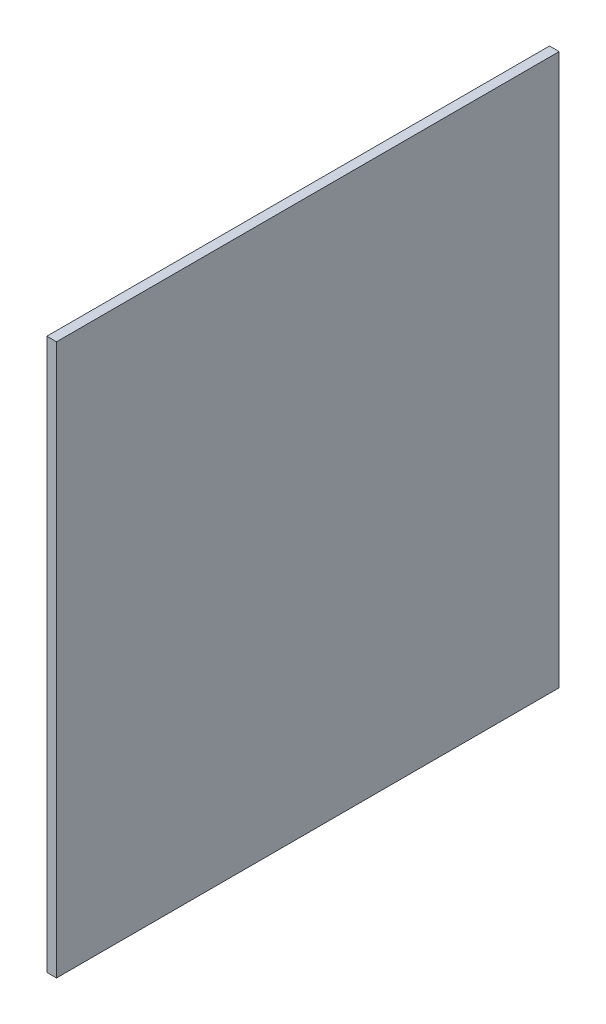
ISO-10303-21;
HEADER;
FILE_DESCRIPTION(('STEP AP214'),'2;1');
FILE_NAME('part.step','',(''),(''),'','','');
FILE_SCHEMA(('AUTOMOTIVE_DESIGN { 1 0 10303 214 1 1 1 1 }'));
ENDSEC;
DATA;
#1=APPLICATION_CONTEXT('core data for automotive mechanical design processes');
#2=APPLICATION_PROTOCOL_DEFINITION('international standard','automotive_design',2000,#1);
#3=PRODUCT_CONTEXT('',#1,'mechanical');
#4=PRODUCT('Part','Part','',(#3));
#5=PRODUCT_RELATED_PRODUCT_CATEGORY('part','',(#4));
#6=PRODUCT_DEFINITION_FORMATION('','',#4);
#7=PRODUCT_DEFINITION_CONTEXT('part definition',#1,'design');
#8=PRODUCT_DEFINITION('design','',#6,#7);
#9=PRODUCT_DEFINITION_SHAPE('','',#8);
#10=(LENGTH_UNIT() NAMED_UNIT(*) SI_UNIT(.MILLI.,.METRE.));
#11=(NAMED_UNIT(*) PLANE_ANGLE_UNIT() SI_UNIT($,.RADIAN.));
#12=(NAMED_UNIT(*) SI_UNIT($,.STERADIAN.) SOLID_ANGLE_UNIT());
#13=UNCERTAINTY_MEASURE_WITH_UNIT(LENGTH_MEASURE(1.E-05),#10,'distance_accuracy_value','');
#14=(GEOMETRIC_REPRESENTATION_CONTEXT(3) GLOBAL_UNCERTAINTY_ASSIGNED_CONTEXT((#13)) GLOBAL_UNIT_ASSIGNED_CONTEXT((#10,
#11,#12)) REPRESENTATION_CONTEXT('',''));
#15=CARTESIAN_POINT('',(0.,0.,0.));
#16=DIRECTION('',(0.,0.,1.));
#17=DIRECTION('',(1.,0.,0.));
#18=AXIS2_PLACEMENT_3D('',#15,#16,#17);
#19=CARTESIAN_POINT('',(10.,232.128252788104,406.877323420075));
#20=DIRECTION('',(0.,0.,-1.));
#21=DIRECTION('',(0.,1.,0.));
#22=AXIS2_PLACEMENT_3D('',#19,#20,#21);
#23=PLANE('',#22);
#24=DIRECTION('',(0.,-1.,0.));
#25=VECTOR('',#24,1.);
#26=CARTESIAN_POINT('',(0.,232.128252788104,406.877323420075));
#27=LINE('',#26,#25);
#28=CARTESIAN_POINT('',(0.,232.128252788104,406.877323420075));
#29=VERTEX_POINT('',#28);
#30=CARTESIAN_POINT('',(0.,-337.871747211896,406.877323420074));
#31=VERTEX_POINT('',#30);
#32=EDGE_CURVE('E96',#29,#31,#27,.T.);
#33=ORIENTED_EDGE('',*,*,#32,.T.);
#34=DIRECTION('',(-1.,0.,0.));
#35=VECTOR('',#34,1.);
#36=CARTESIAN_POINT('',(10.,-337.871747211896,406.877323420074));
#37=LINE('',#36,#35);
#38=CARTESIAN_POINT('',(10.,-337.871747211896,406.877323420074));
#39=VERTEX_POINT('',#38);
#40=EDGE_CURVE('E11',#39,#31,#37,.T.);
#41=ORIENTED_EDGE('',*,*,#40,.F.);
#42=DIRECTION('',(0.,-1.,0.));
#43=VECTOR('',#42,1.);
#44=CARTESIAN_POINT('',(10.,232.128252788104,406.877323420075));
#45=LINE('',#44,#43);
#46=CARTESIAN_POINT('',(10.,232.128252788104,406.877323420075));
#47=VERTEX_POINT('',#46);
#48=EDGE_CURVE('E84',#47,#39,#45,.T.);
#49=ORIENTED_EDGE('',*,*,#48,.F.);
#50=DIRECTION('',(-1.,0.,0.));
#51=VECTOR('',#50,1.);
#52=CARTESIAN_POINT('',(10.,232.128252788104,406.877323420075));
#53=LINE('',#52,#51);
#54=EDGE_CURVE('E92',#47,#29,#53,.T.);
#55=ORIENTED_EDGE('',*,*,#54,.T.);
#56=EDGE_LOOP('',(#33,#41,#49,#55));
#57=FACE_BOUND('',#56,.T.);
#58=ADVANCED_FACE('F33',(#57),#23,.F.);
#59=CARTESIAN_POINT('',(10.,-337.871747211896,406.877323420074));
#60=DIRECTION('',(0.,1.,0.));
#61=DIRECTION('',(0.,0.,1.));
#62=AXIS2_PLACEMENT_3D('',#59,#60,#61);
#63=PLANE('',#62);
#64=DIRECTION('',(0.,0.,-1.));
#65=VECTOR('',#64,1.);
#66=CARTESIAN_POINT('',(0.,-337.871747211896,406.877323420074));
#67=LINE('',#66,#65);
#68=CARTESIAN_POINT('',(0.,-337.871747211896,-113.122676579926));
#69=VERTEX_POINT('',#68);
#70=EDGE_CURVE('E88',#31,#69,#67,.T.);
#71=ORIENTED_EDGE('',*,*,#70,.T.);
#72=DIRECTION('',(-1.,0.,0.));
#73=VECTOR('',#72,1.);
#74=CARTESIAN_POINT('',(10.,-337.871747211896,-113.122676579926));
#75=LINE('',#74,#73);
#76=CARTESIAN_POINT('',(10.,-337.871747211896,-113.122676579926));
#77=VERTEX_POINT('',#76);
#78=EDGE_CURVE('E41',#77,#69,#75,.T.);
#79=ORIENTED_EDGE('',*,*,#78,.F.);
#80=DIRECTION('',(0.,0.,-1.));
#81=VECTOR('',#80,1.);
#82=CARTESIAN_POINT('',(10.,-337.871747211896,406.877323420074));
#83=LINE('',#82,#81);
#84=EDGE_CURVE('E79',#39,#77,#83,.T.);
#85=ORIENTED_EDGE('',*,*,#84,.F.);
#86=ORIENTED_EDGE('',*,*,#40,.T.);
#87=EDGE_LOOP('',(#71,#79,#85,#86));
#88=FACE_BOUND('',#87,.T.);
#89=ADVANCED_FACE('F87',(#88),#63,.F.);
#90=CARTESIAN_POINT('',(10.,232.128252788104,-113.122676579926));
#91=DIRECTION('',(0.,0.,1.));
#92=DIRECTION('',(0.,-1.,0.));
#93=AXIS2_PLACEMENT_3D('',#90,#91,#92);
#94=PLANE('',#93);
#95=DIRECTION('',(0.,1.,0.));
#96=VECTOR('',#95,1.);
#97=CARTESIAN_POINT('',(0.,232.128252788104,-113.122676579926));
#98=LINE('',#97,#96);
#99=CARTESIAN_POINT('',(0.,232.128252788104,-113.122676579926));
#100=VERTEX_POINT('',#99);
#101=EDGE_CURVE('E66',#69,#100,#98,.T.);
#102=ORIENTED_EDGE('',*,*,#101,.T.);
#103=DIRECTION('',(-1.,0.,0.));
#104=VECTOR('',#103,1.);
#105=CARTESIAN_POINT('',(10.,232.128252788104,-113.122676579926));
#106=LINE('',#105,#104);
#107=CARTESIAN_POINT('',(10.,232.128252788104,-113.122676579926));
#108=VERTEX_POINT('',#107);
#109=EDGE_CURVE('E89',#108,#100,#106,.T.);
#110=ORIENTED_EDGE('',*,*,#109,.F.);
#111=DIRECTION('',(0.,1.,0.));
#112=VECTOR('',#111,1.);
#113=CARTESIAN_POINT('',(10.,232.128252788104,-113.122676579926));
#114=LINE('',#113,#112);
#115=EDGE_CURVE('E82',#77,#108,#114,.T.);
#116=ORIENTED_EDGE('',*,*,#115,.F.);
#117=ORIENTED_EDGE('',*,*,#78,.T.);
#118=EDGE_LOOP('',(#102,#110,#116,#117));
#119=FACE_BOUND('',#118,.T.);
#120=ADVANCED_FACE('F90',(#119),#94,.F.);
#121=CARTESIAN_POINT('',(10.,232.128252788104,406.877323420075));
#122=DIRECTION('',(0.,-1.,0.));
#123=DIRECTION('',(0.,0.,-1.));
#124=AXIS2_PLACEMENT_3D('',#121,#122,#123);
#125=PLANE('',#124);
#126=DIRECTION('',(0.,0.,1.));
#127=VECTOR('',#126,1.);
#128=CARTESIAN_POINT('',(0.,232.128252788104,406.877323420075));
#129=LINE('',#128,#127);
#130=EDGE_CURVE('E72',#100,#29,#129,.T.);
#131=ORIENTED_EDGE('',*,*,#130,.T.);
#132=ORIENTED_EDGE('',*,*,#54,.F.);
#133=DIRECTION('',(0.,0.,1.));
#134=VECTOR('',#133,1.);
#135=CARTESIAN_POINT('',(10.,232.128252788104,406.877323420075));
#136=LINE('',#135,#134);
#137=EDGE_CURVE('E49',#108,#47,#136,.T.);
#138=ORIENTED_EDGE('',*,*,#137,.F.);
#139=ORIENTED_EDGE('',*,*,#109,.T.);
#140=EDGE_LOOP('',(#131,#132,#138,#139));
#141=FACE_BOUND('',#140,.T.);
#142=ADVANCED_FACE('F103',(#141),#125,.F.);
#143=CARTESIAN_POINT('',(10.,0.,0.));
#144=DIRECTION('',(1.,0.,0.));
#145=DIRECTION('',(0.,0.,-1.));
#146=AXIS2_PLACEMENT_3D('',#143,#144,#145);
#147=PLANE('',#146);
#148=ORIENTED_EDGE('',*,*,#48,.T.);
#149=ORIENTED_EDGE('',*,*,#84,.T.);
#150=ORIENTED_EDGE('',*,*,#115,.T.);
#151=ORIENTED_EDGE('',*,*,#137,.T.);
#152=EDGE_LOOP('',(#148,#149,#150,#151));
#153=FACE_BOUND('',#152,.T.);
#154=ADVANCED_FACE('F80',(#153),#147,.T.);
#155=CARTESIAN_POINT('',(0.,0.,0.));
#156=DIRECTION('',(1.,0.,0.));
#157=DIRECTION('',(0.,0.,-1.));
#158=AXIS2_PLACEMENT_3D('',#155,#156,#157);
#159=PLANE('',#158);
#160=ORIENTED_EDGE('',*,*,#32,.F.);
#161=ORIENTED_EDGE('',*,*,#130,.F.);
#162=ORIENTED_EDGE('',*,*,#101,.F.);
#163=ORIENTED_EDGE('',*,*,#70,.F.);
#164=EDGE_LOOP('',(#160,#161,#162,#163));
#165=FACE_BOUND('',#164,.T.);
#166=ADVANCED_FACE('F106',(#165),#159,.F.);
#167=CLOSED_SHELL('',(#58,#89,#120,#142,#154,#166));
#168=MANIFOLD_SOLID_BREP('B2',#167);
#169=ADVANCED_BREP_SHAPE_REPRESENTATION('',(#18,#168),#14);
#170=SHAPE_DEFINITION_REPRESENTATION(#9,#169);
ENDSEC;
END-ISO-10303-21;
